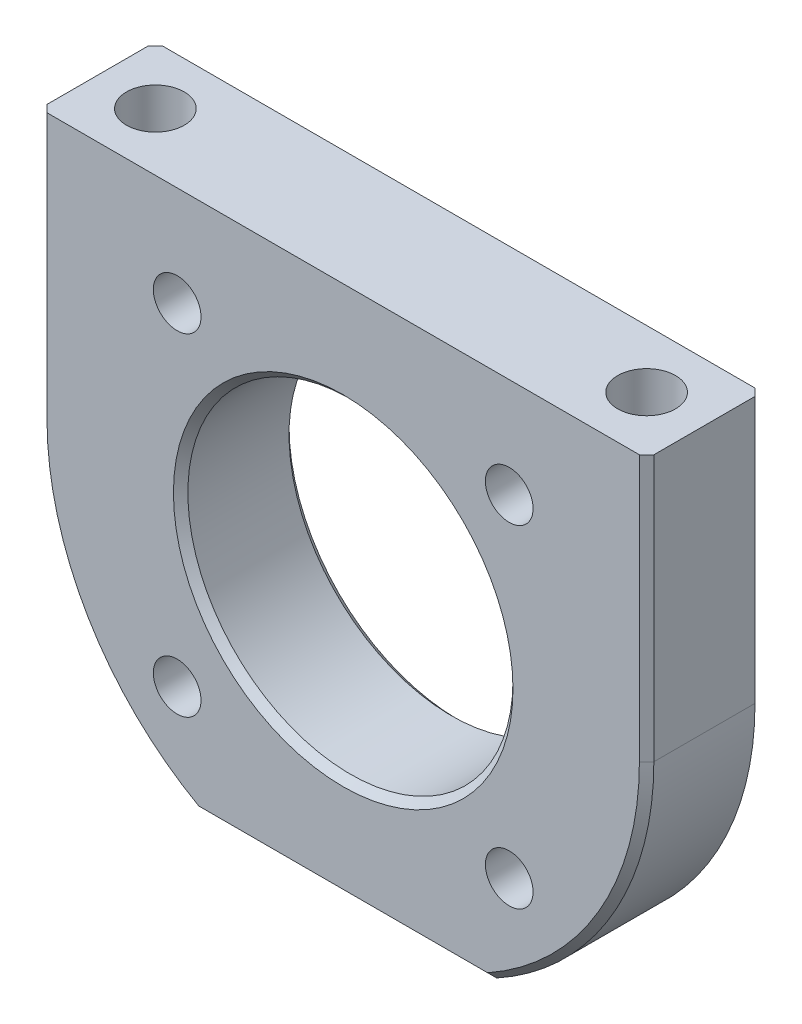
ISO-10303-21;
HEADER;
FILE_DESCRIPTION(('STEP AP214'),'2;1');
FILE_NAME('part.step','',(''),(''),'','','');
FILE_SCHEMA(('AUTOMOTIVE_DESIGN { 1 0 10303 214 1 1 1 1 }'));
ENDSEC;
DATA;
#1=APPLICATION_CONTEXT('core data for automotive mechanical design processes');
#2=APPLICATION_PROTOCOL_DEFINITION('international standard','automotive_design',2000,#1);
#3=PRODUCT_CONTEXT('',#1,'mechanical');
#4=PRODUCT('Part','Part','',(#3));
#5=PRODUCT_RELATED_PRODUCT_CATEGORY('part','',(#4));
#6=PRODUCT_DEFINITION_FORMATION('','',#4);
#7=PRODUCT_DEFINITION_CONTEXT('part definition',#1,'design');
#8=PRODUCT_DEFINITION('design','',#6,#7);
#9=PRODUCT_DEFINITION_SHAPE('','',#8);
#10=(LENGTH_UNIT() NAMED_UNIT(*) SI_UNIT(.MILLI.,.METRE.));
#11=(NAMED_UNIT(*) PLANE_ANGLE_UNIT() SI_UNIT($,.RADIAN.));
#12=(NAMED_UNIT(*) SI_UNIT($,.STERADIAN.) SOLID_ANGLE_UNIT());
#13=UNCERTAINTY_MEASURE_WITH_UNIT(LENGTH_MEASURE(1.E-05),#10,'distance_accuracy_value','');
#14=(GEOMETRIC_REPRESENTATION_CONTEXT(3) GLOBAL_UNCERTAINTY_ASSIGNED_CONTEXT((#13)) GLOBAL_UNIT_ASSIGNED_CONTEXT((#10,
#11,#12)) REPRESENTATION_CONTEXT('',''));
#15=CARTESIAN_POINT('',(0.,0.,0.));
#16=DIRECTION('',(0.,0.,1.));
#17=DIRECTION('',(1.,0.,0.));
#18=AXIS2_PLACEMENT_3D('',#15,#16,#17);
#19=CARTESIAN_POINT('',(-21.,18.4,4.));
#20=DIRECTION('',(0.,-1.,0.));
#21=DIRECTION('',(0.,0.,-1.));
#22=AXIS2_PLACEMENT_3D('',#19,#20,#21);
#23=PLANE('',#22);
#24=CARTESIAN_POINT('',(-17.,18.4,0.));
#25=DIRECTION('',(0.,-1.,0.));
#26=DIRECTION('',(0.,0.,-1.));
#27=AXIS2_PLACEMENT_3D('',#24,#25,#26);
#28=CIRCLE('',#27,2.);
#29=CARTESIAN_POINT('',(-17.,18.4,-2.));
#30=VERTEX_POINT('',#29);
#31=EDGE_CURVE('E145',#30,#30,#28,.T.);
#32=ORIENTED_EDGE('',*,*,#31,.T.);
#33=EDGE_LOOP('',(#32));
#34=FACE_BOUND('',#33,.T.);
#35=DIRECTION('',(0.,0.,-1.));
#36=VECTOR('',#35,1.);
#37=CARTESIAN_POINT('',(-21.,18.4,4.));
#38=LINE('',#37,#36);
#39=CARTESIAN_POINT('',(-21.,18.4,3.49999999999999));
#40=VERTEX_POINT('',#39);
#41=CARTESIAN_POINT('',(-21.,18.4,-3.49999999999999));
#42=VERTEX_POINT('',#41);
#43=EDGE_CURVE('E184',#40,#42,#38,.T.);
#44=ORIENTED_EDGE('',*,*,#43,.F.);
#45=DIRECTION('',(0.707106781186543,0.,0.707106781186552));
#46=VECTOR('',#45,1.);
#47=CARTESIAN_POINT('',(-20.5,18.4,4.));
#48=LINE('',#47,#46);
#49=CARTESIAN_POINT('',(-20.5,18.4,4.));
#50=VERTEX_POINT('',#49);
#51=EDGE_CURVE('E224',#40,#50,#48,.T.);
#52=ORIENTED_EDGE('',*,*,#51,.T.);
#53=DIRECTION('',(-1.,0.,0.));
#54=VECTOR('',#53,1.);
#55=CARTESIAN_POINT('',(-21.,18.4,4.));
#56=LINE('',#55,#54);
#57=CARTESIAN_POINT('',(20.5,18.4,4.));
#58=VERTEX_POINT('',#57);
#59=EDGE_CURVE('E170',#58,#50,#56,.T.);
#60=ORIENTED_EDGE('',*,*,#59,.F.);
#61=DIRECTION('',(0.707106781186543,0.,-0.707106781186552));
#62=VECTOR('',#61,1.);
#63=CARTESIAN_POINT('',(20.5,18.4,4.));
#64=LINE('',#63,#62);
#65=CARTESIAN_POINT('',(21.,18.4,3.49999999999999));
#66=VERTEX_POINT('',#65);
#67=EDGE_CURVE('E222',#58,#66,#64,.T.);
#68=ORIENTED_EDGE('',*,*,#67,.T.);
#69=DIRECTION('',(0.,0.,-1.));
#70=VECTOR('',#69,1.);
#71=CARTESIAN_POINT('',(21.,18.4,4.));
#72=LINE('',#71,#70);
#73=CARTESIAN_POINT('',(21.,18.4,-3.49999999999999));
#74=VERTEX_POINT('',#73);
#75=EDGE_CURVE('E187',#66,#74,#72,.T.);
#76=ORIENTED_EDGE('',*,*,#75,.T.);
#77=DIRECTION('',(0.707106781186548,0.,0.707106781186548));
#78=VECTOR('',#77,1.);
#79=CARTESIAN_POINT('',(21.,18.4,-3.49999999999999));
#80=LINE('',#79,#78);
#81=CARTESIAN_POINT('',(20.5,18.4,-4.));
#82=VERTEX_POINT('',#81);
#83=EDGE_CURVE('E218',#74,#82,#80,.F.);
#84=ORIENTED_EDGE('',*,*,#83,.T.);
#85=DIRECTION('',(-1.,0.,0.));
#86=VECTOR('',#85,1.);
#87=CARTESIAN_POINT('',(-21.,18.4,-4.));
#88=LINE('',#87,#86);
#89=CARTESIAN_POINT('',(-20.5,18.4,-4.));
#90=VERTEX_POINT('',#89);
#91=EDGE_CURVE('E169',#82,#90,#88,.T.);
#92=ORIENTED_EDGE('',*,*,#91,.T.);
#93=DIRECTION('',(0.707106781186548,0.,-0.707106781186548));
#94=VECTOR('',#93,1.);
#95=CARTESIAN_POINT('',(-21.,18.4,-3.49999999999999));
#96=LINE('',#95,#94);
#97=EDGE_CURVE('E220',#90,#42,#96,.F.);
#98=ORIENTED_EDGE('',*,*,#97,.T.);
#99=EDGE_LOOP('',(#44,#52,#60,#68,#76,#84,#92,#98));
#100=FACE_BOUND('',#99,.T.);
#101=CARTESIAN_POINT('',(17.,18.4,0.));
#102=DIRECTION('',(0.,-1.,0.));
#103=DIRECTION('',(0.,0.,-1.));
#104=AXIS2_PLACEMENT_3D('',#101,#102,#103);
#105=CIRCLE('',#104,2.);
#106=CARTESIAN_POINT('',(17.,18.4,-2.));
#107=VERTEX_POINT('',#106);
#108=EDGE_CURVE('E364',#107,#107,#105,.T.);
#109=ORIENTED_EDGE('',*,*,#108,.T.);
#110=EDGE_LOOP('',(#109));
#111=FACE_BOUND('',#110,.T.);
#112=ADVANCED_FACE('F34',(#34,#100,#111),#23,.F.);
#113=CARTESIAN_POINT('',(0.,0.,4.));
#114=DIRECTION('',(0.,0.,-1.));
#115=DIRECTION('',(-1.,0.,0.));
#116=AXIS2_PLACEMENT_3D('',#113,#114,#115);
#117=CYLINDRICAL_SURFACE('',#116,21.);
#118=DIRECTION('',(0.,0.,-1.));
#119=VECTOR('',#118,1.);
#120=CARTESIAN_POINT('',(21.,0.,4.));
#121=LINE('',#120,#119);
#122=CARTESIAN_POINT('',(21.,0.,3.49999999999999));
#123=VERTEX_POINT('',#122);
#124=CARTESIAN_POINT('',(21.,0.,-3.49999999999999));
#125=VERTEX_POINT('',#124);
#126=EDGE_CURVE('E190',#123,#125,#121,.T.);
#127=ORIENTED_EDGE('',*,*,#126,.F.);
#128=CARTESIAN_POINT('',(0.,0.,3.49999999999999));
#129=DIRECTION('',(0.,0.,1.));
#130=DIRECTION('',(1.,0.,0.));
#131=AXIS2_PLACEMENT_3D('',#128,#129,#130);
#132=CIRCLE('',#131,21.);
#133=CARTESIAN_POINT('',(10.121264743104,-18.4,3.49999999999999));
#134=VERTEX_POINT('',#133);
#135=EDGE_CURVE('E236',#123,#134,#132,.F.);
#136=ORIENTED_EDGE('',*,*,#135,.T.);
#137=DIRECTION('',(0.,0.,-1.));
#138=VECTOR('',#137,1.);
#139=CARTESIAN_POINT('',(10.121264743104,-18.4,4.));
#140=LINE('',#139,#138);
#141=CARTESIAN_POINT('',(10.121264743104,-18.4,-3.49999999999999));
#142=VERTEX_POINT('',#141);
#143=EDGE_CURVE('E173',#134,#142,#140,.T.);
#144=ORIENTED_EDGE('',*,*,#143,.T.);
#145=CARTESIAN_POINT('',(0.,0.,-3.49999999999999));
#146=DIRECTION('',(0.,0.,1.));
#147=DIRECTION('',(1.,0.,0.));
#148=AXIS2_PLACEMENT_3D('',#145,#146,#147);
#149=CIRCLE('',#148,21.);
#150=EDGE_CURVE('E234',#142,#125,#149,.T.);
#151=ORIENTED_EDGE('',*,*,#150,.T.);
#152=EDGE_LOOP('',(#127,#136,#144,#151));
#153=FACE_BOUND('',#152,.T.);
#154=ADVANCED_FACE('F320',(#153),#117,.T.);
#155=CARTESIAN_POINT('',(21.,0.,4.));
#156=DIRECTION('',(-1.,0.,0.));
#157=DIRECTION('',(0.,0.,1.));
#158=AXIS2_PLACEMENT_3D('',#155,#156,#157);
#159=PLANE('',#158);
#160=ORIENTED_EDGE('',*,*,#75,.F.);
#161=DIRECTION('',(0.,-1.,0.));
#162=VECTOR('',#161,1.);
#163=CARTESIAN_POINT('',(21.,0.,3.49999999999999));
#164=LINE('',#163,#162);
#165=EDGE_CURVE('E240',#66,#123,#164,.T.);
#166=ORIENTED_EDGE('',*,*,#165,.T.);
#167=ORIENTED_EDGE('',*,*,#126,.T.);
#168=DIRECTION('',(0.,1.,0.));
#169=VECTOR('',#168,1.);
#170=CARTESIAN_POINT('',(21.,0.,-3.49999999999999));
#171=LINE('',#170,#169);
#172=EDGE_CURVE('E238',#125,#74,#171,.T.);
#173=ORIENTED_EDGE('',*,*,#172,.T.);
#174=EDGE_LOOP('',(#160,#166,#167,#173));
#175=FACE_BOUND('',#174,.T.);
#176=ADVANCED_FACE('F326',(#175),#159,.F.);
#177=CARTESIAN_POINT('',(-21.,0.,4.));
#178=DIRECTION('',(1.,0.,0.));
#179=DIRECTION('',(0.,0.,-1.));
#180=AXIS2_PLACEMENT_3D('',#177,#178,#179);
#181=PLANE('',#180);
#182=DIRECTION('',(0.,0.,-1.));
#183=VECTOR('',#182,1.);
#184=CARTESIAN_POINT('',(-21.,0.,4.));
#185=LINE('',#184,#183);
#186=CARTESIAN_POINT('',(-21.,0.,3.49999999999999));
#187=VERTEX_POINT('',#186);
#188=CARTESIAN_POINT('',(-21.,0.,-3.49999999999999));
#189=VERTEX_POINT('',#188);
#190=EDGE_CURVE('E181',#187,#189,#185,.T.);
#191=ORIENTED_EDGE('',*,*,#190,.F.);
#192=DIRECTION('',(0.,1.,0.));
#193=VECTOR('',#192,1.);
#194=CARTESIAN_POINT('',(-21.,18.4,3.49999999999999));
#195=LINE('',#194,#193);
#196=EDGE_CURVE('E216',#187,#40,#195,.T.);
#197=ORIENTED_EDGE('',*,*,#196,.T.);
#198=ORIENTED_EDGE('',*,*,#43,.T.);
#199=DIRECTION('',(0.,-1.,0.));
#200=VECTOR('',#199,1.);
#201=CARTESIAN_POINT('',(-21.,0.,-3.49999999999999));
#202=LINE('',#201,#200);
#203=EDGE_CURVE('E213',#42,#189,#202,.T.);
#204=ORIENTED_EDGE('',*,*,#203,.T.);
#205=EDGE_LOOP('',(#191,#197,#198,#204));
#206=FACE_BOUND('',#205,.T.);
#207=ADVANCED_FACE('F333',(#206),#181,.F.);
#208=CARTESIAN_POINT('',(0.,0.,4.));
#209=DIRECTION('',(0.,0.,-1.));
#210=DIRECTION('',(-1.,0.,0.));
#211=AXIS2_PLACEMENT_3D('',#208,#209,#210);
#212=CYLINDRICAL_SURFACE('',#211,21.);
#213=DIRECTION('',(0.,0.,-1.));
#214=VECTOR('',#213,1.);
#215=CARTESIAN_POINT('',(-10.121264743104,-18.4,4.));
#216=LINE('',#215,#214);
#217=CARTESIAN_POINT('',(-10.121264743104,-18.4,3.49999999999999));
#218=VERTEX_POINT('',#217);
#219=CARTESIAN_POINT('',(-10.121264743104,-18.4,-3.49999999999999));
#220=VERTEX_POINT('',#219);
#221=EDGE_CURVE('E178',#218,#220,#216,.T.);
#222=ORIENTED_EDGE('',*,*,#221,.F.);
#223=CARTESIAN_POINT('',(0.,0.,3.49999999999999));
#224=DIRECTION('',(0.,0.,1.));
#225=DIRECTION('',(1.,0.,0.));
#226=AXIS2_PLACEMENT_3D('',#223,#224,#225);
#227=CIRCLE('',#226,21.);
#228=EDGE_CURVE('E228',#218,#187,#227,.F.);
#229=ORIENTED_EDGE('',*,*,#228,.T.);
#230=ORIENTED_EDGE('',*,*,#190,.T.);
#231=CARTESIAN_POINT('',(0.,0.,-3.49999999999999));
#232=DIRECTION('',(0.,0.,1.));
#233=DIRECTION('',(1.,0.,0.));
#234=AXIS2_PLACEMENT_3D('',#231,#232,#233);
#235=CIRCLE('',#234,21.);
#236=EDGE_CURVE('E226',#189,#220,#235,.T.);
#237=ORIENTED_EDGE('',*,*,#236,.T.);
#238=EDGE_LOOP('',(#222,#229,#230,#237));
#239=FACE_BOUND('',#238,.T.);
#240=ADVANCED_FACE('F394',(#239),#212,.T.);
#241=CARTESIAN_POINT('',(-10.121264743104,-18.4,4.));
#242=DIRECTION('',(0.,1.,0.));
#243=DIRECTION('',(0.,0.,1.));
#244=AXIS2_PLACEMENT_3D('',#241,#242,#243);
#245=PLANE('',#244);
#246=ORIENTED_EDGE('',*,*,#143,.F.);
#247=DIRECTION('',(-1.,0.,0.));
#248=VECTOR('',#247,1.);
#249=CARTESIAN_POINT('',(-10.121264743104,-18.4,3.49999999999999));
#250=LINE('',#249,#248);
#251=EDGE_CURVE('E232',#134,#218,#250,.T.);
#252=ORIENTED_EDGE('',*,*,#251,.T.);
#253=ORIENTED_EDGE('',*,*,#221,.T.);
#254=DIRECTION('',(1.,0.,0.));
#255=VECTOR('',#254,1.);
#256=CARTESIAN_POINT('',(-10.121264743104,-18.4,-3.49999999999999));
#257=LINE('',#256,#255);
#258=EDGE_CURVE('E230',#220,#142,#257,.T.);
#259=ORIENTED_EDGE('',*,*,#258,.T.);
#260=EDGE_LOOP('',(#246,#252,#253,#259));
#261=FACE_BOUND('',#260,.T.);
#262=ADVANCED_FACE('F378',(#261),#245,.F.);
#263=CARTESIAN_POINT('',(0.,0.,4.));
#264=DIRECTION('',(0.,0.,1.));
#265=DIRECTION('',(1.,0.,0.));
#266=AXIS2_PLACEMENT_3D('',#263,#264,#265);
#267=PLANE('',#266);
#268=CARTESIAN_POINT('',(0.,0.,4.));
#269=DIRECTION('',(0.,0.,1.));
#270=DIRECTION('',(1.,0.,0.));
#271=AXIS2_PLACEMENT_3D('',#268,#269,#270);
#272=CIRCLE('',#271,11.75);
#273=CARTESIAN_POINT('',(11.75,0.,4.));
#274=VERTEX_POINT('',#273);
#275=EDGE_CURVE('E210',#274,#274,#272,.F.);
#276=ORIENTED_EDGE('',*,*,#275,.T.);
#277=EDGE_LOOP('',(#276));
#278=FACE_BOUND('',#277,.T.);
#279=CARTESIAN_POINT('',(-11.4904851942814,11.4904851942814,4.));
#280=DIRECTION('',(0.,0.,1.));
#281=DIRECTION('',(1.,0.,0.));
#282=AXIS2_PLACEMENT_3D('',#279,#280,#281);
#283=CIRCLE('',#282,1.64999999999999);
#284=CARTESIAN_POINT('',(-9.84048519428139,11.4904851942814,4.));
#285=VERTEX_POINT('',#284);
#286=EDGE_CURVE('E138',#285,#285,#283,.T.);
#287=ORIENTED_EDGE('',*,*,#286,.F.);
#288=EDGE_LOOP('',(#287));
#289=FACE_BOUND('',#288,.T.);
#290=CARTESIAN_POINT('',(11.4904851942814,11.4904851942814,4.));
#291=DIRECTION('',(0.,0.,1.));
#292=DIRECTION('',(1.,0.,0.));
#293=AXIS2_PLACEMENT_3D('',#290,#291,#292);
#294=CIRCLE('',#293,1.64999999999999);
#295=CARTESIAN_POINT('',(13.1404851942814,11.4904851942814,4.));
#296=VERTEX_POINT('',#295);
#297=EDGE_CURVE('E151',#296,#296,#294,.T.);
#298=ORIENTED_EDGE('',*,*,#297,.F.);
#299=EDGE_LOOP('',(#298));
#300=FACE_BOUND('',#299,.T.);
#301=CARTESIAN_POINT('',(11.4904851942814,-11.4904851942814,4.));
#302=DIRECTION('',(0.,0.,1.));
#303=DIRECTION('',(1.,0.,0.));
#304=AXIS2_PLACEMENT_3D('',#301,#302,#303);
#305=CIRCLE('',#304,1.64999999999999);
#306=CARTESIAN_POINT('',(13.1404851942814,-11.4904851942814,4.));
#307=VERTEX_POINT('',#306);
#308=EDGE_CURVE('E157',#307,#307,#305,.T.);
#309=ORIENTED_EDGE('',*,*,#308,.F.);
#310=EDGE_LOOP('',(#309));
#311=FACE_BOUND('',#310,.T.);
#312=CARTESIAN_POINT('',(-11.4904851942814,-11.4904851942814,4.));
#313=DIRECTION('',(0.,0.,1.));
#314=DIRECTION('',(1.,0.,0.));
#315=AXIS2_PLACEMENT_3D('',#312,#313,#314);
#316=CIRCLE('',#315,1.64999999999999);
#317=CARTESIAN_POINT('',(-9.84048519428139,-11.4904851942814,4.));
#318=VERTEX_POINT('',#317);
#319=EDGE_CURVE('E163',#318,#318,#316,.T.);
#320=ORIENTED_EDGE('',*,*,#319,.F.);
#321=EDGE_LOOP('',(#320));
#322=FACE_BOUND('',#321,.T.);
#323=ORIENTED_EDGE('',*,*,#59,.T.);
#324=DIRECTION('',(0.,-1.,0.));
#325=VECTOR('',#324,1.);
#326=CARTESIAN_POINT('',(-20.5,0.,4.));
#327=LINE('',#326,#325);
#328=CARTESIAN_POINT('',(-20.5,0.,4.));
#329=VERTEX_POINT('',#328);
#330=EDGE_CURVE('E207',#50,#329,#327,.T.);
#331=ORIENTED_EDGE('',*,*,#330,.T.);
#332=CARTESIAN_POINT('',(0.,0.,4.));
#333=DIRECTION('',(0.,0.,1.));
#334=DIRECTION('',(1.,0.,0.));
#335=AXIS2_PLACEMENT_3D('',#332,#333,#334);
#336=CIRCLE('',#335,20.5);
#337=CARTESIAN_POINT('',(-9.99199679743744,-17.9,4.));
#338=VERTEX_POINT('',#337);
#339=EDGE_CURVE('E205',#329,#338,#336,.T.);
#340=ORIENTED_EDGE('',*,*,#339,.T.);
#341=DIRECTION('',(1.,0.,0.));
#342=VECTOR('',#341,1.);
#343=CARTESIAN_POINT('',(10.121264743104,-17.9,4.));
#344=LINE('',#343,#342);
#345=CARTESIAN_POINT('',(9.99199679743744,-17.9,4.));
#346=VERTEX_POINT('',#345);
#347=EDGE_CURVE('E203',#338,#346,#344,.T.);
#348=ORIENTED_EDGE('',*,*,#347,.T.);
#349=CARTESIAN_POINT('',(0.,0.,4.));
#350=DIRECTION('',(0.,0.,1.));
#351=DIRECTION('',(1.,0.,0.));
#352=AXIS2_PLACEMENT_3D('',#349,#350,#351);
#353=CIRCLE('',#352,20.5);
#354=CARTESIAN_POINT('',(20.5,0.,4.));
#355=VERTEX_POINT('',#354);
#356=EDGE_CURVE('E201',#346,#355,#353,.T.);
#357=ORIENTED_EDGE('',*,*,#356,.T.);
#358=DIRECTION('',(0.,1.,0.));
#359=VECTOR('',#358,1.);
#360=CARTESIAN_POINT('',(20.5,18.4,4.));
#361=LINE('',#360,#359);
#362=EDGE_CURVE('E199',#355,#58,#361,.T.);
#363=ORIENTED_EDGE('',*,*,#362,.T.);
#364=EDGE_LOOP('',(#323,#331,#340,#348,#357,#363));
#365=FACE_BOUND('',#364,.T.);
#366=ADVANCED_FACE('F354',(#278,#289,#300,#311,#322,#365),#267,.T.);
#367=CARTESIAN_POINT('',(0.,0.,-4.));
#368=DIRECTION('',(0.,0.,1.));
#369=DIRECTION('',(1.,0.,0.));
#370=AXIS2_PLACEMENT_3D('',#367,#368,#369);
#371=PLANE('',#370);
#372=CARTESIAN_POINT('',(0.,0.,-4.));
#373=DIRECTION('',(0.,0.,1.));
#374=DIRECTION('',(1.,0.,0.));
#375=AXIS2_PLACEMENT_3D('',#372,#373,#374);
#376=CIRCLE('',#375,11.75);
#377=CARTESIAN_POINT('',(11.75,0.,-4.));
#378=VERTEX_POINT('',#377);
#379=EDGE_CURVE('E11',#378,#378,#376,.T.);
#380=ORIENTED_EDGE('',*,*,#379,.T.);
#381=EDGE_LOOP('',(#380));
#382=FACE_BOUND('',#381,.T.);
#383=CARTESIAN_POINT('',(-11.4904851942814,11.4904851942814,-4.00000000000001));
#384=DIRECTION('',(0.,0.,1.));
#385=DIRECTION('',(1.,0.,0.));
#386=AXIS2_PLACEMENT_3D('',#383,#384,#385);
#387=CIRCLE('',#386,1.64999999999999);
#388=CARTESIAN_POINT('',(-9.84048519428139,11.4904851942814,-4.00000000000001));
#389=VERTEX_POINT('',#388);
#390=EDGE_CURVE('E142',#389,#389,#387,.T.);
#391=ORIENTED_EDGE('',*,*,#390,.T.);
#392=EDGE_LOOP('',(#391));
#393=FACE_BOUND('',#392,.T.);
#394=CARTESIAN_POINT('',(11.4904851942814,11.4904851942814,-4.00000000000001));
#395=DIRECTION('',(0.,0.,1.));
#396=DIRECTION('',(1.,0.,0.));
#397=AXIS2_PLACEMENT_3D('',#394,#395,#396);
#398=CIRCLE('',#397,1.64999999999999);
#399=CARTESIAN_POINT('',(13.1404851942814,11.4904851942814,-4.00000000000001));
#400=VERTEX_POINT('',#399);
#401=EDGE_CURVE('E154',#400,#400,#398,.T.);
#402=ORIENTED_EDGE('',*,*,#401,.T.);
#403=EDGE_LOOP('',(#402));
#404=FACE_BOUND('',#403,.T.);
#405=CARTESIAN_POINT('',(11.4904851942814,-11.4904851942814,-4.00000000000001));
#406=DIRECTION('',(0.,0.,1.));
#407=DIRECTION('',(1.,0.,0.));
#408=AXIS2_PLACEMENT_3D('',#405,#406,#407);
#409=CIRCLE('',#408,1.64999999999999);
#410=CARTESIAN_POINT('',(13.1404851942814,-11.4904851942814,-4.00000000000001));
#411=VERTEX_POINT('',#410);
#412=EDGE_CURVE('E160',#411,#411,#409,.T.);
#413=ORIENTED_EDGE('',*,*,#412,.T.);
#414=EDGE_LOOP('',(#413));
#415=FACE_BOUND('',#414,.T.);
#416=CARTESIAN_POINT('',(-11.4904851942814,-11.4904851942814,-4.00000000000001));
#417=DIRECTION('',(0.,0.,1.));
#418=DIRECTION('',(1.,0.,0.));
#419=AXIS2_PLACEMENT_3D('',#416,#417,#418);
#420=CIRCLE('',#419,1.64999999999999);
#421=CARTESIAN_POINT('',(-9.84048519428139,-11.4904851942814,-4.00000000000001));
#422=VERTEX_POINT('',#421);
#423=EDGE_CURVE('E166',#422,#422,#420,.T.);
#424=ORIENTED_EDGE('',*,*,#423,.T.);
#425=EDGE_LOOP('',(#424));
#426=FACE_BOUND('',#425,.T.);
#427=CARTESIAN_POINT('',(0.,0.,-4.));
#428=DIRECTION('',(0.,0.,1.));
#429=DIRECTION('',(1.,0.,0.));
#430=AXIS2_PLACEMENT_3D('',#427,#428,#429);
#431=CIRCLE('',#430,20.5);
#432=CARTESIAN_POINT('',(-9.99199679743744,-17.9,-4.));
#433=VERTEX_POINT('',#432);
#434=CARTESIAN_POINT('',(-20.5,0.,-4.));
#435=VERTEX_POINT('',#434);
#436=EDGE_CURVE('E51',#433,#435,#431,.F.);
#437=ORIENTED_EDGE('',*,*,#436,.T.);
#438=DIRECTION('',(0.,1.,0.));
#439=VECTOR('',#438,1.);
#440=CARTESIAN_POINT('',(-20.5,0.,-4.));
#441=LINE('',#440,#439);
#442=EDGE_CURVE('E43',#435,#90,#441,.T.);
#443=ORIENTED_EDGE('',*,*,#442,.T.);
#444=ORIENTED_EDGE('',*,*,#91,.F.);
#445=DIRECTION('',(0.,-1.,0.));
#446=VECTOR('',#445,1.);
#447=CARTESIAN_POINT('',(20.5,0.,-4.));
#448=LINE('',#447,#446);
#449=CARTESIAN_POINT('',(20.5,0.,-4.));
#450=VERTEX_POINT('',#449);
#451=EDGE_CURVE('E242',#82,#450,#448,.T.);
#452=ORIENTED_EDGE('',*,*,#451,.T.);
#453=CARTESIAN_POINT('',(0.,0.,-4.));
#454=DIRECTION('',(0.,0.,1.));
#455=DIRECTION('',(1.,0.,0.));
#456=AXIS2_PLACEMENT_3D('',#453,#454,#455);
#457=CIRCLE('',#456,20.5);
#458=CARTESIAN_POINT('',(9.99199679743744,-17.9,-4.));
#459=VERTEX_POINT('',#458);
#460=EDGE_CURVE('E244',#450,#459,#457,.F.);
#461=ORIENTED_EDGE('',*,*,#460,.T.);
#462=DIRECTION('',(-1.,0.,0.));
#463=VECTOR('',#462,1.);
#464=CARTESIAN_POINT('',(0.,-17.9,-4.));
#465=LINE('',#464,#463);
#466=EDGE_CURVE('E56',#459,#433,#465,.T.);
#467=ORIENTED_EDGE('',*,*,#466,.T.);
#468=EDGE_LOOP('',(#437,#443,#444,#452,#461,#467));
#469=FACE_BOUND('',#468,.T.);
#470=ADVANCED_FACE('F390',(#382,#393,#404,#415,#426,#469),#371,.F.);
#471=CARTESIAN_POINT('',(0.,0.,-4.));
#472=DIRECTION('',(0.,0.,1.));
#473=DIRECTION('',(1.,0.,0.));
#474=AXIS2_PLACEMENT_3D('',#471,#472,#473);
#475=CYLINDRICAL_SURFACE('',#474,11.25);
#476=CARTESIAN_POINT('',(0.,0.,3.5));
#477=DIRECTION('',(0.,0.,1.));
#478=DIRECTION('',(1.,0.,0.));
#479=AXIS2_PLACEMENT_3D('',#476,#477,#478);
#480=CIRCLE('',#479,11.25);
#481=CARTESIAN_POINT('',(11.25,0.,3.5));
#482=VERTEX_POINT('',#481);
#483=EDGE_CURVE('E196',#482,#482,#480,.T.);
#484=ORIENTED_EDGE('',*,*,#483,.T.);
#485=EDGE_LOOP('',(#484));
#486=FACE_BOUND('',#485,.T.);
#487=CARTESIAN_POINT('',(0.,0.,-3.5));
#488=DIRECTION('',(0.,0.,1.));
#489=DIRECTION('',(1.,0.,0.));
#490=AXIS2_PLACEMENT_3D('',#487,#488,#489);
#491=CIRCLE('',#490,11.25);
#492=CARTESIAN_POINT('',(11.25,0.,-3.5));
#493=VERTEX_POINT('',#492);
#494=EDGE_CURVE('E193',#493,#493,#491,.F.);
#495=ORIENTED_EDGE('',*,*,#494,.T.);
#496=EDGE_LOOP('',(#495));
#497=FACE_BOUND('',#496,.T.);
#498=ADVANCED_FACE('F559',(#486,#497),#475,.F.);
#499=CARTESIAN_POINT('',(-11.4904851942814,-11.4904851942814,4.));
#500=DIRECTION('',(0.,0.,1.));
#501=DIRECTION('',(1.,0.,0.));
#502=AXIS2_PLACEMENT_3D('',#499,#500,#501);
#503=CYLINDRICAL_SURFACE('',#502,1.64999999999999);
#504=ORIENTED_EDGE('',*,*,#423,.F.);
#505=EDGE_LOOP('',(#504));
#506=FACE_BOUND('',#505,.T.);
#507=ORIENTED_EDGE('',*,*,#319,.T.);
#508=EDGE_LOOP('',(#507));
#509=FACE_BOUND('',#508,.T.);
#510=ADVANCED_FACE('F549',(#506,#509),#503,.F.);
#511=CARTESIAN_POINT('',(11.4904851942814,-11.4904851942814,4.));
#512=DIRECTION('',(0.,0.,1.));
#513=DIRECTION('',(1.,0.,0.));
#514=AXIS2_PLACEMENT_3D('',#511,#512,#513);
#515=CYLINDRICAL_SURFACE('',#514,1.64999999999999);
#516=ORIENTED_EDGE('',*,*,#412,.F.);
#517=EDGE_LOOP('',(#516));
#518=FACE_BOUND('',#517,.T.);
#519=ORIENTED_EDGE('',*,*,#308,.T.);
#520=EDGE_LOOP('',(#519));
#521=FACE_BOUND('',#520,.T.);
#522=ADVANCED_FACE('F539',(#518,#521),#515,.F.);
#523=CARTESIAN_POINT('',(11.4904851942814,11.4904851942814,4.));
#524=DIRECTION('',(0.,0.,1.));
#525=DIRECTION('',(1.,0.,0.));
#526=AXIS2_PLACEMENT_3D('',#523,#524,#525);
#527=CYLINDRICAL_SURFACE('',#526,1.64999999999999);
#528=ORIENTED_EDGE('',*,*,#401,.F.);
#529=EDGE_LOOP('',(#528));
#530=FACE_BOUND('',#529,.T.);
#531=ORIENTED_EDGE('',*,*,#297,.T.);
#532=EDGE_LOOP('',(#531));
#533=FACE_BOUND('',#532,.T.);
#534=ADVANCED_FACE('F529',(#530,#533),#527,.F.);
#535=CARTESIAN_POINT('',(-11.4904851942814,11.4904851942814,4.));
#536=DIRECTION('',(0.,0.,1.));
#537=DIRECTION('',(1.,0.,0.));
#538=AXIS2_PLACEMENT_3D('',#535,#536,#537);
#539=CYLINDRICAL_SURFACE('',#538,1.64999999999999);
#540=ORIENTED_EDGE('',*,*,#390,.F.);
#541=EDGE_LOOP('',(#540));
#542=FACE_BOUND('',#541,.T.);
#543=ORIENTED_EDGE('',*,*,#286,.T.);
#544=EDGE_LOOP('',(#543));
#545=FACE_BOUND('',#544,.T.);
#546=ADVANCED_FACE('F502',(#542,#545),#539,.F.);
#547=CARTESIAN_POINT('',(-17.,10.4,0.));
#548=DIRECTION('',(0.,-1.,0.));
#549=DIRECTION('',(0.,0.,-1.));
#550=AXIS2_PLACEMENT_3D('',#547,#548,#549);
#551=PLANE('',#550);
#552=CARTESIAN_POINT('',(-17.,10.4,0.));
#553=DIRECTION('',(0.,-1.,0.));
#554=DIRECTION('',(0.,0.,-1.));
#555=AXIS2_PLACEMENT_3D('',#552,#553,#554);
#556=CIRCLE('',#555,2.);
#557=CARTESIAN_POINT('',(-17.,10.4,-2.));
#558=VERTEX_POINT('',#557);
#559=EDGE_CURVE('E139',#558,#558,#556,.T.);
#560=ORIENTED_EDGE('',*,*,#559,.F.);
#561=EDGE_LOOP('',(#560));
#562=FACE_BOUND('',#561,.T.);
#563=CARTESIAN_POINT('',(-17.,10.4,0.));
#564=DIRECTION('',(0.,-1.,0.));
#565=DIRECTION('',(0.,0.,-1.));
#566=AXIS2_PLACEMENT_3D('',#563,#564,#565);
#567=CIRCLE('',#566,1.64999999999999);
#568=CARTESIAN_POINT('',(-17.,10.4,-1.64999999999999));
#569=VERTEX_POINT('',#568);
#570=EDGE_CURVE('E136',#569,#569,#567,.F.);
#571=ORIENTED_EDGE('',*,*,#570,.F.);
#572=EDGE_LOOP('',(#571));
#573=FACE_BOUND('',#572,.T.);
#574=ADVANCED_FACE('F493',(#562,#573),#551,.F.);
#575=CARTESIAN_POINT('',(-17.,10.4,0.));
#576=DIRECTION('',(0.,1.,0.));
#577=DIRECTION('',(0.,0.,1.));
#578=AXIS2_PLACEMENT_3D('',#575,#576,#577);
#579=CYLINDRICAL_SURFACE('',#578,2.);
#580=ORIENTED_EDGE('',*,*,#559,.T.);
#581=EDGE_LOOP('',(#580));
#582=FACE_BOUND('',#581,.T.);
#583=ORIENTED_EDGE('',*,*,#31,.F.);
#584=EDGE_LOOP('',(#583));
#585=FACE_BOUND('',#584,.T.);
#586=ADVANCED_FACE('F132',(#582,#585),#579,.F.);
#587=CARTESIAN_POINT('',(-17.,10.4,0.));
#588=DIRECTION('',(0.,1.,0.));
#589=DIRECTION('',(0.,0.,1.));
#590=AXIS2_PLACEMENT_3D('',#587,#588,#589);
#591=CONICAL_SURFACE('',#590,1.65,1.02974425867665);
#592=CARTESIAN_POINT('',(-17.,9.40857997860453,0.));
#593=VERTEX_POINT('',#592);
#594=VERTEX_LOOP('',#593);
#595=FACE_BOUND('',#594,.T.);
#596=ORIENTED_EDGE('',*,*,#570,.T.);
#597=EDGE_LOOP('',(#596));
#598=FACE_BOUND('',#597,.T.);
#599=ADVANCED_FACE('F128',(#595,#598),#591,.F.);
#600=CARTESIAN_POINT('',(17.,10.4,0.));
#601=DIRECTION('',(0.,-1.,0.));
#602=DIRECTION('',(0.,0.,-1.));
#603=AXIS2_PLACEMENT_3D('',#600,#601,#602);
#604=PLANE('',#603);
#605=CARTESIAN_POINT('',(17.,10.4,0.));
#606=DIRECTION('',(0.,-1.,0.));
#607=DIRECTION('',(0.,0.,-1.));
#608=AXIS2_PLACEMENT_3D('',#605,#606,#607);
#609=CIRCLE('',#608,2.);
#610=CARTESIAN_POINT('',(17.,10.4,-2.));
#611=VERTEX_POINT('',#610);
#612=EDGE_CURVE('E366',#611,#611,#609,.T.);
#613=ORIENTED_EDGE('',*,*,#612,.F.);
#614=EDGE_LOOP('',(#613));
#615=FACE_BOUND('',#614,.T.);
#616=CARTESIAN_POINT('',(17.,10.4,0.));
#617=DIRECTION('',(0.,-1.,0.));
#618=DIRECTION('',(0.,0.,-1.));
#619=AXIS2_PLACEMENT_3D('',#616,#617,#618);
#620=CIRCLE('',#619,1.65);
#621=CARTESIAN_POINT('',(17.,10.4,-1.65));
#622=VERTEX_POINT('',#621);
#623=EDGE_CURVE('E668',#622,#622,#620,.F.);
#624=ORIENTED_EDGE('',*,*,#623,.F.);
#625=EDGE_LOOP('',(#624));
#626=FACE_BOUND('',#625,.T.);
#627=ADVANCED_FACE('F131',(#615,#626),#604,.F.);
#628=CARTESIAN_POINT('',(17.,10.4,0.));
#629=DIRECTION('',(0.,1.,0.));
#630=DIRECTION('',(0.,0.,1.));
#631=AXIS2_PLACEMENT_3D('',#628,#629,#630);
#632=CYLINDRICAL_SURFACE('',#631,2.);
#633=ORIENTED_EDGE('',*,*,#612,.T.);
#634=EDGE_LOOP('',(#633));
#635=FACE_BOUND('',#634,.T.);
#636=ORIENTED_EDGE('',*,*,#108,.F.);
#637=EDGE_LOOP('',(#636));
#638=FACE_BOUND('',#637,.T.);
#639=ADVANCED_FACE('F471',(#635,#638),#632,.F.);
#640=CARTESIAN_POINT('',(17.,10.4,0.));
#641=DIRECTION('',(0.,1.,0.));
#642=DIRECTION('',(0.,0.,1.));
#643=AXIS2_PLACEMENT_3D('',#640,#641,#642);
#644=CONICAL_SURFACE('',#643,1.65,1.02974425867665);
#645=CARTESIAN_POINT('',(17.,9.40857997860453,0.));
#646=VERTEX_POINT('',#645);
#647=VERTEX_LOOP('',#646);
#648=FACE_BOUND('',#647,.T.);
#649=ORIENTED_EDGE('',*,*,#623,.T.);
#650=EDGE_LOOP('',(#649));
#651=FACE_BOUND('',#650,.T.);
#652=ADVANCED_FACE('F339',(#648,#651),#644,.F.);
#653=CARTESIAN_POINT('',(0.,0.,3.5));
#654=DIRECTION('',(0.,0.,1.));
#655=DIRECTION('',(1.,0.,0.));
#656=AXIS2_PLACEMENT_3D('',#653,#654,#655);
#657=CONICAL_SURFACE('',#656,11.25,0.785398163397441);
#658=ORIENTED_EDGE('',*,*,#275,.F.);
#659=EDGE_LOOP('',(#658));
#660=FACE_BOUND('',#659,.T.);
#661=ORIENTED_EDGE('',*,*,#483,.F.);
#662=EDGE_LOOP('',(#661));
#663=FACE_BOUND('',#662,.T.);
#664=ADVANCED_FACE('F281',(#660,#663),#657,.F.);
#665=CARTESIAN_POINT('',(20.5,0.,4.));
#666=DIRECTION('',(0.707106781186552,0.,0.707106781186542));
#667=DIRECTION('',(0.,-1.,0.));
#668=AXIS2_PLACEMENT_3D('',#665,#666,#667);
#669=PLANE('',#668);
#670=ORIENTED_EDGE('',*,*,#67,.F.);
#671=ORIENTED_EDGE('',*,*,#362,.F.);
#672=DIRECTION('',(-0.707106781186542,0.,0.707106781186552));
#673=VECTOR('',#672,1.);
#674=CARTESIAN_POINT('',(21.,0.,3.49999999999999));
#675=LINE('',#674,#673);
#676=EDGE_CURVE('E360',#123,#355,#675,.T.);
#677=ORIENTED_EDGE('',*,*,#676,.F.);
#678=ORIENTED_EDGE('',*,*,#165,.F.);
#679=EDGE_LOOP('',(#670,#671,#677,#678));
#680=FACE_BOUND('',#679,.T.);
#681=ADVANCED_FACE('F277',(#680),#669,.T.);
#682=CARTESIAN_POINT('',(0.,0.,4.));
#683=DIRECTION('',(0.,0.,-1.));
#684=DIRECTION('',(-1.,0.,0.));
#685=AXIS2_PLACEMENT_3D('',#682,#683,#684);
#686=CONICAL_SURFACE('',#685,20.5,0.785398163397441);
#687=ORIENTED_EDGE('',*,*,#676,.T.);
#688=ORIENTED_EDGE('',*,*,#356,.F.);
#689=CARTESIAN_POINT('',(9.99199679743744,-17.9,4.));
#690=CARTESIAN_POINT('',(10.0136754445202,-17.9833160131249,3.91668398687511));
#691=CARTESIAN_POINT('',(10.0352870969088,-18.0666406865163,3.83335931348374));
#692=CARTESIAN_POINT('',(10.07837641213,-18.2333073531831,3.66669264681694));
#693=CARTESIAN_POINT('',(10.0998540749636,-18.3166493464583,3.58335065354164));
#694=CARTESIAN_POINT('',(10.121264743104,-18.4,3.49999999999999));
#695=B_SPLINE_CURVE_WITH_KNOTS('',3,(#689,#690,#691,#692,#693,#694),.UNSPECIFIED.,.F.,.F.,(4,2,
4),(0.,0.359412845060824,0.718825687322924),.UNSPECIFIED.);
#696=EDGE_CURVE('E259',#134,#346,#695,.F.);
#697=ORIENTED_EDGE('',*,*,#696,.F.);
#698=ORIENTED_EDGE('',*,*,#135,.F.);
#699=EDGE_LOOP('',(#687,#688,#697,#698));
#700=FACE_BOUND('',#699,.T.);
#701=ADVANCED_FACE('F273',(#700),#686,.T.);
#702=CARTESIAN_POINT('',(0.,-17.9,4.));
#703=DIRECTION('',(0.,-0.707106781186552,0.707106781186542));
#704=DIRECTION('',(-1.,0.,0.));
#705=AXIS2_PLACEMENT_3D('',#702,#703,#704);
#706=PLANE('',#705);
#707=ORIENTED_EDGE('',*,*,#696,.T.);
#708=ORIENTED_EDGE('',*,*,#347,.F.);
#709=CARTESIAN_POINT('',(-9.99199679743744,-17.9,4.));
#710=CARTESIAN_POINT('',(-10.0136754445202,-17.9833160131249,3.91668398687511));
#711=CARTESIAN_POINT('',(-10.0352870969088,-18.0666406865163,3.83335931348374));
#712=CARTESIAN_POINT('',(-10.07837641213,-18.2333073531831,3.66669264681694));
#713=CARTESIAN_POINT('',(-10.0998540749636,-18.3166493464584,3.58335065354164));
#714=CARTESIAN_POINT('',(-10.121264743104,-18.4,3.49999999999999));
#715=B_SPLINE_CURVE_WITH_KNOTS('',3,(#709,#710,#711,#712,#713,#714),.UNSPECIFIED.,.F.,.F.,(4,2,
4),(0.,0.359412845060829,0.718825687322928),.UNSPECIFIED.);
#716=EDGE_CURVE('E251',#218,#338,#715,.F.);
#717=ORIENTED_EDGE('',*,*,#716,.F.);
#718=ORIENTED_EDGE('',*,*,#251,.F.);
#719=EDGE_LOOP('',(#707,#708,#717,#718));
#720=FACE_BOUND('',#719,.T.);
#721=ADVANCED_FACE('F265',(#720),#706,.T.);
#722=CARTESIAN_POINT('',(0.,0.,4.));
#723=DIRECTION('',(0.,0.,-1.));
#724=DIRECTION('',(-1.,0.,0.));
#725=AXIS2_PLACEMENT_3D('',#722,#723,#724);
#726=CONICAL_SURFACE('',#725,20.5,0.785398163397441);
#727=ORIENTED_EDGE('',*,*,#716,.T.);
#728=ORIENTED_EDGE('',*,*,#339,.F.);
#729=DIRECTION('',(0.707106781186542,0.,0.707106781186552));
#730=VECTOR('',#729,1.);
#731=CARTESIAN_POINT('',(-21.,0.,3.49999999999999));
#732=LINE('',#731,#730);
#733=EDGE_CURVE('E249',#187,#329,#732,.T.);
#734=ORIENTED_EDGE('',*,*,#733,.F.);
#735=ORIENTED_EDGE('',*,*,#228,.F.);
#736=EDGE_LOOP('',(#727,#728,#734,#735));
#737=FACE_BOUND('',#736,.T.);
#738=ADVANCED_FACE('F268',(#737),#726,.T.);
#739=CARTESIAN_POINT('',(-20.5,0.,4.));
#740=DIRECTION('',(-0.707106781186552,0.,0.707106781186542));
#741=DIRECTION('',(0.,1.,0.));
#742=AXIS2_PLACEMENT_3D('',#739,#740,#741);
#743=PLANE('',#742);
#744=ORIENTED_EDGE('',*,*,#51,.F.);
#745=ORIENTED_EDGE('',*,*,#196,.F.);
#746=ORIENTED_EDGE('',*,*,#733,.T.);
#747=ORIENTED_EDGE('',*,*,#330,.F.);
#748=EDGE_LOOP('',(#744,#745,#746,#747));
#749=FACE_BOUND('',#748,.T.);
#750=ADVANCED_FACE('F271',(#749),#743,.T.);
#751=CARTESIAN_POINT('',(0.,0.,-4.));
#752=DIRECTION('',(0.,0.,-1.));
#753=DIRECTION('',(-1.,0.,0.));
#754=AXIS2_PLACEMENT_3D('',#751,#752,#753);
#755=CONICAL_SURFACE('',#754,11.75,0.785398163397447);
#756=ORIENTED_EDGE('',*,*,#494,.F.);
#757=EDGE_LOOP('',(#756));
#758=FACE_BOUND('',#757,.T.);
#759=ORIENTED_EDGE('',*,*,#379,.F.);
#760=EDGE_LOOP('',(#759));
#761=FACE_BOUND('',#760,.T.);
#762=ADVANCED_FACE('F283',(#758,#761),#755,.F.);
#763=CARTESIAN_POINT('',(21.,0.,-3.49999999999999));
#764=DIRECTION('',(-0.707106781186547,0.,0.707106781186547));
#765=DIRECTION('',(0.,1.,0.));
#766=AXIS2_PLACEMENT_3D('',#763,#764,#765);
#767=PLANE('',#766);
#768=ORIENTED_EDGE('',*,*,#83,.F.);
#769=ORIENTED_EDGE('',*,*,#172,.F.);
#770=DIRECTION('',(0.707106781186547,0.,0.707106781186547));
#771=VECTOR('',#770,1.);
#772=CARTESIAN_POINT('',(20.5,0.,-4.));
#773=LINE('',#772,#771);
#774=EDGE_CURVE('E38',#450,#125,#773,.T.);
#775=ORIENTED_EDGE('',*,*,#774,.F.);
#776=ORIENTED_EDGE('',*,*,#451,.F.);
#777=EDGE_LOOP('',(#768,#769,#775,#776));
#778=FACE_BOUND('',#777,.T.);
#779=ADVANCED_FACE('F36',(#778),#767,.F.);
#780=CARTESIAN_POINT('',(0.,0.,-3.49999999999999));
#781=DIRECTION('',(0.,0.,1.));
#782=DIRECTION('',(1.,0.,0.));
#783=AXIS2_PLACEMENT_3D('',#780,#781,#782);
#784=CONICAL_SURFACE('',#783,21.,0.785398163397448);
#785=ORIENTED_EDGE('',*,*,#774,.T.);
#786=ORIENTED_EDGE('',*,*,#150,.F.);
#787=CARTESIAN_POINT('',(10.121264743104,-18.4,-3.49999999999999));
#788=CARTESIAN_POINT('',(10.0998540749636,-18.3166493464583,-3.58335065354164));
#789=CARTESIAN_POINT('',(10.07837641213,-18.2333073531831,-3.66669264681694));
#790=CARTESIAN_POINT('',(10.0352870969088,-18.0666406865162,-3.83335931348374));
#791=CARTESIAN_POINT('',(10.0136754445202,-17.9833160131249,-3.91668398687511));
#792=CARTESIAN_POINT('',(9.99199679743744,-17.9,-4.));
#793=B_SPLINE_CURVE_WITH_KNOTS('',3,(#787,#788,#789,#790,#791,#792),.UNSPECIFIED.,.F.,.F.,(4,2,
4),(0.,0.359412842262102,0.71882568732293),.UNSPECIFIED.);
#794=EDGE_CURVE('E306',#459,#142,#793,.F.);
#795=ORIENTED_EDGE('',*,*,#794,.F.);
#796=ORIENTED_EDGE('',*,*,#460,.F.);
#797=EDGE_LOOP('',(#785,#786,#795,#796));
#798=FACE_BOUND('',#797,.T.);
#799=ADVANCED_FACE('F296',(#798),#784,.T.);
#800=CARTESIAN_POINT('',(-10.121264743104,-18.4,-3.49999999999999));
#801=DIRECTION('',(0.,0.707106781186547,0.707106781186547));
#802=DIRECTION('',(1.,0.,0.));
#803=AXIS2_PLACEMENT_3D('',#800,#801,#802);
#804=PLANE('',#803);
#805=ORIENTED_EDGE('',*,*,#794,.T.);
#806=ORIENTED_EDGE('',*,*,#258,.F.);
#807=CARTESIAN_POINT('',(-10.121264743104,-18.4,-3.49999999999999));
#808=CARTESIAN_POINT('',(-10.0998540749636,-18.3166493464583,-3.58335065354164));
#809=CARTESIAN_POINT('',(-10.07837641213,-18.2333073531831,-3.66669264681694));
#810=CARTESIAN_POINT('',(-10.0352870969088,-18.0666406865162,-3.83335931348374));
#811=CARTESIAN_POINT('',(-10.0136754445202,-17.9833160131249,-3.91668398687511));
#812=CARTESIAN_POINT('',(-9.99199679743744,-17.9,-4.));
#813=B_SPLINE_CURVE_WITH_KNOTS('',3,(#807,#808,#809,#810,#811,#812),.UNSPECIFIED.,.F.,.F.,(4,2,
4),(0.,0.359412842262101,0.718825687322932),.UNSPECIFIED.);
#814=EDGE_CURVE('E301',#433,#220,#813,.F.);
#815=ORIENTED_EDGE('',*,*,#814,.F.);
#816=ORIENTED_EDGE('',*,*,#466,.F.);
#817=EDGE_LOOP('',(#805,#806,#815,#816));
#818=FACE_BOUND('',#817,.T.);
#819=ADVANCED_FACE('F292',(#818),#804,.F.);
#820=CARTESIAN_POINT('',(0.,0.,-3.49999999999999));
#821=DIRECTION('',(0.,0.,1.));
#822=DIRECTION('',(1.,0.,0.));
#823=AXIS2_PLACEMENT_3D('',#820,#821,#822);
#824=CONICAL_SURFACE('',#823,21.,0.785398163397448);
#825=ORIENTED_EDGE('',*,*,#814,.T.);
#826=ORIENTED_EDGE('',*,*,#236,.F.);
#827=DIRECTION('',(-0.707106781186547,0.,0.707106781186547));
#828=VECTOR('',#827,1.);
#829=CARTESIAN_POINT('',(-20.5,0.,-4.));
#830=LINE('',#829,#828);
#831=EDGE_CURVE('E368',#435,#189,#830,.T.);
#832=ORIENTED_EDGE('',*,*,#831,.F.);
#833=ORIENTED_EDGE('',*,*,#436,.F.);
#834=EDGE_LOOP('',(#825,#826,#832,#833));
#835=FACE_BOUND('',#834,.T.);
#836=ADVANCED_FACE('F290',(#835),#824,.T.);
#837=CARTESIAN_POINT('',(-21.,0.,-3.49999999999999));
#838=DIRECTION('',(0.707106781186547,0.,0.707106781186547));
#839=DIRECTION('',(0.,-1.,0.));
#840=AXIS2_PLACEMENT_3D('',#837,#838,#839);
#841=PLANE('',#840);
#842=ORIENTED_EDGE('',*,*,#97,.F.);
#843=ORIENTED_EDGE('',*,*,#442,.F.);
#844=ORIENTED_EDGE('',*,*,#831,.T.);
#845=ORIENTED_EDGE('',*,*,#203,.F.);
#846=EDGE_LOOP('',(#842,#843,#844,#845));
#847=FACE_BOUND('',#846,.T.);
#848=ADVANCED_FACE('F287',(#847),#841,.F.);
#849=CLOSED_SHELL('',(#112,#154,#176,#207,#240,#262,#366,#470,#498,#510,#522,#534,#546,#574,
#586,#599,#627,#639,#652,#664,#681,#701,#721,#738,#750,#762,#779,#799,#819,#836,#848));
#850=MANIFOLD_SOLID_BREP('B2',#849);
#851=ADVANCED_BREP_SHAPE_REPRESENTATION('',(#18,#850),#14);
#852=SHAPE_DEFINITION_REPRESENTATION(#9,#851);
ENDSEC;
END-ISO-10303-21;
